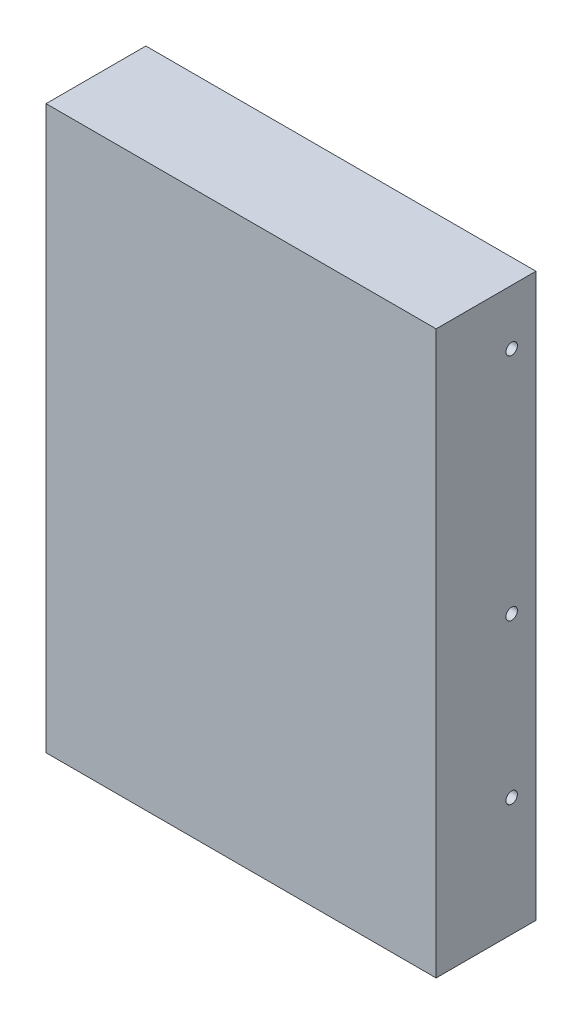
ISO-10303-21;
HEADER;
FILE_DESCRIPTION(('STEP AP214'),'2;1');
FILE_NAME('part.step','',(''),(''),'','','');
FILE_SCHEMA(('AUTOMOTIVE_DESIGN { 1 0 10303 214 1 1 1 1 }'));
ENDSEC;
DATA;
#1=APPLICATION_CONTEXT('core data for automotive mechanical design processes');
#2=APPLICATION_PROTOCOL_DEFINITION('international standard','automotive_design',2000,#1);
#3=PRODUCT_CONTEXT('',#1,'mechanical');
#4=PRODUCT('Part','Part','',(#3));
#5=PRODUCT_RELATED_PRODUCT_CATEGORY('part','',(#4));
#6=PRODUCT_DEFINITION_FORMATION('','',#4);
#7=PRODUCT_DEFINITION_CONTEXT('part definition',#1,'design');
#8=PRODUCT_DEFINITION('design','',#6,#7);
#9=PRODUCT_DEFINITION_SHAPE('','',#8);
#10=(LENGTH_UNIT() NAMED_UNIT(*) SI_UNIT(.MILLI.,.METRE.));
#11=(NAMED_UNIT(*) PLANE_ANGLE_UNIT() SI_UNIT($,.RADIAN.));
#12=(NAMED_UNIT(*) SI_UNIT($,.STERADIAN.) SOLID_ANGLE_UNIT());
#13=UNCERTAINTY_MEASURE_WITH_UNIT(LENGTH_MEASURE(1.E-05),#10,'distance_accuracy_value','');
#14=(GEOMETRIC_REPRESENTATION_CONTEXT(3) GLOBAL_UNCERTAINTY_ASSIGNED_CONTEXT((#13)) GLOBAL_UNIT_ASSIGNED_CONTEXT((#10,
#11,#12)) REPRESENTATION_CONTEXT('',''));
#15=CARTESIAN_POINT('',(0.,0.,0.));
#16=DIRECTION('',(0.,0.,1.));
#17=DIRECTION('',(1.,0.,0.));
#18=AXIS2_PLACEMENT_3D('',#15,#16,#17);
#19=CARTESIAN_POINT('',(23.934782608696,0.,2.434782608696));
#20=DIRECTION('',(0.,1.,0.));
#21=DIRECTION('',(0.,0.,1.));
#22=AXIS2_PLACEMENT_3D('',#19,#20,#21);
#23=PLANE('',#22);
#24=DIRECTION('',(1.,0.,0.));
#25=VECTOR('',#24,1.);
#26=CARTESIAN_POINT('',(33.,0.,2.));
#27=LINE('',#26,#25);
#28=CARTESIAN_POINT('',(13.,0.,2.));
#29=VERTEX_POINT('',#28);
#30=CARTESIAN_POINT('',(33.,0.,2.));
#31=VERTEX_POINT('',#30);
#32=EDGE_CURVE('E173',#29,#31,#27,.T.);
#33=ORIENTED_EDGE('',*,*,#32,.T.);
#34=DIRECTION('',(0.,0.,-1.));
#35=VECTOR('',#34,1.);
#36=CARTESIAN_POINT('',(33.,0.,1.));
#37=LINE('',#36,#35);
#38=CARTESIAN_POINT('',(33.,0.,1.));
#39=VERTEX_POINT('',#38);
#40=EDGE_CURVE('E319',#31,#39,#37,.T.);
#41=ORIENTED_EDGE('',*,*,#40,.T.);
#42=DIRECTION('',(1.,0.,0.));
#43=VECTOR('',#42,1.);
#44=CARTESIAN_POINT('',(34.,0.,1.));
#45=LINE('',#44,#43);
#46=CARTESIAN_POINT('',(34.,0.,1.));
#47=VERTEX_POINT('',#46);
#48=EDGE_CURVE('E314',#39,#47,#45,.T.);
#49=ORIENTED_EDGE('',*,*,#48,.T.);
#50=DIRECTION('',(0.,0.,1.));
#51=VECTOR('',#50,1.);
#52=CARTESIAN_POINT('',(34.,0.,3.));
#53=LINE('',#52,#51);
#54=CARTESIAN_POINT('',(34.,0.,3.));
#55=VERTEX_POINT('',#54);
#56=EDGE_CURVE('E156',#47,#55,#53,.T.);
#57=ORIENTED_EDGE('',*,*,#56,.T.);
#58=DIRECTION('',(1.,0.,0.));
#59=VECTOR('',#58,1.);
#60=CARTESIAN_POINT('',(13.,0.,3.));
#61=LINE('',#60,#59);
#62=CARTESIAN_POINT('',(13.,0.,3.));
#63=VERTEX_POINT('',#62);
#64=EDGE_CURVE('E153',#55,#63,#61,.F.);
#65=ORIENTED_EDGE('',*,*,#64,.T.);
#66=DIRECTION('',(0.,0.,1.));
#67=VECTOR('',#66,1.);
#68=CARTESIAN_POINT('',(13.,0.,3.));
#69=LINE('',#68,#67);
#70=EDGE_CURVE('E150',#29,#63,#69,.T.);
#71=ORIENTED_EDGE('',*,*,#70,.F.);
#72=EDGE_LOOP('',(#33,#41,#49,#57,#65,#71));
#73=FACE_BOUND('',#72,.T.);
#74=ADVANCED_FACE('F16',(#73),#23,.F.);
#75=CARTESIAN_POINT('',(40.994378109453,0.,2.375621890547));
#76=DIRECTION('',(0.,1.,0.));
#77=DIRECTION('',(0.,0.,1.));
#78=AXIS2_PLACEMENT_3D('',#75,#76,#77);
#79=PLANE('',#78);
#80=DIRECTION('',(0.,0.,1.));
#81=VECTOR('',#80,1.);
#82=CARTESIAN_POINT('',(37.34,0.,2.));
#83=LINE('',#82,#81);
#84=CARTESIAN_POINT('',(37.34,0.,1.));
#85=VERTEX_POINT('',#84);
#86=CARTESIAN_POINT('',(37.34,0.,2.));
#87=VERTEX_POINT('',#86);
#88=EDGE_CURVE('E296',#85,#87,#83,.T.);
#89=ORIENTED_EDGE('',*,*,#88,.T.);
#90=DIRECTION('',(1.,0.,0.));
#91=VECTOR('',#90,1.);
#92=CARTESIAN_POINT('',(46.4,0.,2.));
#93=LINE('',#92,#91);
#94=CARTESIAN_POINT('',(46.4,0.,2.));
#95=VERTEX_POINT('',#94);
#96=EDGE_CURVE('E291',#87,#95,#93,.T.);
#97=ORIENTED_EDGE('',*,*,#96,.T.);
#98=DIRECTION('',(0.,0.,1.));
#99=VECTOR('',#98,1.);
#100=CARTESIAN_POINT('',(46.4,0.,3.));
#101=LINE('',#100,#99);
#102=CARTESIAN_POINT('',(46.4,0.,3.));
#103=VERTEX_POINT('',#102);
#104=EDGE_CURVE('E286',#95,#103,#101,.T.);
#105=ORIENTED_EDGE('',*,*,#104,.T.);
#106=DIRECTION('',(1.,0.,0.));
#107=VECTOR('',#106,1.);
#108=CARTESIAN_POINT('',(36.34,0.,3.));
#109=LINE('',#108,#107);
#110=CARTESIAN_POINT('',(36.34,0.,3.));
#111=VERTEX_POINT('',#110);
#112=EDGE_CURVE('E278',#103,#111,#109,.F.);
#113=ORIENTED_EDGE('',*,*,#112,.T.);
#114=DIRECTION('',(0.,0.,-1.));
#115=VECTOR('',#114,1.);
#116=CARTESIAN_POINT('',(36.34,0.,1.));
#117=LINE('',#116,#115);
#118=CARTESIAN_POINT('',(36.34,0.,1.));
#119=VERTEX_POINT('',#118);
#120=EDGE_CURVE('E306',#111,#119,#117,.T.);
#121=ORIENTED_EDGE('',*,*,#120,.T.);
#122=DIRECTION('',(1.,0.,0.));
#123=VECTOR('',#122,1.);
#124=CARTESIAN_POINT('',(37.34,0.,1.));
#125=LINE('',#124,#123);
#126=EDGE_CURVE('E301',#119,#85,#125,.T.);
#127=ORIENTED_EDGE('',*,*,#126,.T.);
#128=EDGE_LOOP('',(#89,#97,#105,#113,#121,#127));
#129=FACE_BOUND('',#128,.T.);
#130=ADVANCED_FACE('F353',(#129),#79,.F.);
#131=CARTESIAN_POINT('',(13.,0.,3.));
#132=DIRECTION('',(0.,0.,-1.));
#133=DIRECTION('',(0.,1.,0.));
#134=AXIS2_PLACEMENT_3D('',#131,#132,#133);
#135=PLANE('',#134);
#136=DIRECTION('',(0.,1.,0.));
#137=VECTOR('',#136,1.);
#138=CARTESIAN_POINT('',(34.,0.,3.));
#139=LINE('',#138,#137);
#140=CARTESIAN_POINT('',(34.,5.,3.));
#141=VERTEX_POINT('',#140);
#142=EDGE_CURVE('E312',#55,#141,#139,.T.);
#143=ORIENTED_EDGE('',*,*,#142,.T.);
#144=DIRECTION('',(1.,0.,0.));
#145=VECTOR('',#144,1.);
#146=CARTESIAN_POINT('',(29.5,5.,3.));
#147=LINE('',#146,#145);
#148=CARTESIAN_POINT('',(13.,5.,3.));
#149=VERTEX_POINT('',#148);
#150=EDGE_CURVE('E164',#141,#149,#147,.F.);
#151=ORIENTED_EDGE('',*,*,#150,.T.);
#152=DIRECTION('',(0.,1.,0.));
#153=VECTOR('',#152,1.);
#154=CARTESIAN_POINT('',(13.,0.,3.));
#155=LINE('',#154,#153);
#156=EDGE_CURVE('E159',#63,#149,#155,.T.);
#157=ORIENTED_EDGE('',*,*,#156,.F.);
#158=ORIENTED_EDGE('',*,*,#64,.F.);
#159=EDGE_LOOP('',(#143,#151,#157,#158));
#160=FACE_BOUND('',#159,.T.);
#161=ADVANCED_FACE('F162',(#160),#135,.F.);
#162=CARTESIAN_POINT('',(13.,0.,3.));
#163=DIRECTION('',(-1.,0.,0.));
#164=DIRECTION('',(0.,0.,1.));
#165=AXIS2_PLACEMENT_3D('',#162,#163,#164);
#166=PLANE('',#165);
#167=DIRECTION('',(0.,-1.,0.));
#168=VECTOR('',#167,1.);
#169=CARTESIAN_POINT('',(13.,0.,2.));
#170=LINE('',#169,#168);
#171=CARTESIAN_POINT('',(13.,5.,2.));
#172=VERTEX_POINT('',#171);
#173=EDGE_CURVE('E171',#172,#29,#170,.T.);
#174=ORIENTED_EDGE('',*,*,#173,.T.);
#175=ORIENTED_EDGE('',*,*,#70,.T.);
#176=ORIENTED_EDGE('',*,*,#156,.T.);
#177=DIRECTION('',(0.,0.,1.));
#178=VECTOR('',#177,1.);
#179=CARTESIAN_POINT('',(13.,5.,2.25));
#180=LINE('',#179,#178);
#181=EDGE_CURVE('E275',#149,#172,#180,.F.);
#182=ORIENTED_EDGE('',*,*,#181,.T.);
#183=EDGE_LOOP('',(#174,#175,#176,#182));
#184=FACE_BOUND('',#183,.T.);
#185=ADVANCED_FACE('F170',(#184),#166,.T.);
#186=CARTESIAN_POINT('',(33.,0.,2.));
#187=DIRECTION('',(0.,0.,1.));
#188=DIRECTION('',(0.,-1.,0.));
#189=AXIS2_PLACEMENT_3D('',#186,#187,#188);
#190=PLANE('',#189);
#191=ORIENTED_EDGE('',*,*,#173,.F.);
#192=DIRECTION('',(1.,0.,0.));
#193=VECTOR('',#192,1.);
#194=CARTESIAN_POINT('',(29.5,5.,2.));
#195=LINE('',#194,#193);
#196=CARTESIAN_POINT('',(33.,5.,2.));
#197=VERTEX_POINT('',#196);
#198=EDGE_CURVE('E272',#172,#197,#195,.T.);
#199=ORIENTED_EDGE('',*,*,#198,.T.);
#200=DIRECTION('',(0.,1.,0.));
#201=VECTOR('',#200,1.);
#202=CARTESIAN_POINT('',(33.,0.,2.));
#203=LINE('',#202,#201);
#204=EDGE_CURVE('E321',#197,#31,#203,.F.);
#205=ORIENTED_EDGE('',*,*,#204,.T.);
#206=ORIENTED_EDGE('',*,*,#32,.F.);
#207=EDGE_LOOP('',(#191,#199,#205,#206));
#208=FACE_BOUND('',#207,.T.);
#209=ADVANCED_FACE('F328',(#208),#190,.F.);
#210=CARTESIAN_POINT('',(33.,0.,1.));
#211=DIRECTION('',(1.,0.,0.));
#212=DIRECTION('',(0.,0.,-1.));
#213=AXIS2_PLACEMENT_3D('',#210,#211,#212);
#214=PLANE('',#213);
#215=ORIENTED_EDGE('',*,*,#204,.F.);
#216=DIRECTION('',(0.,0.,1.));
#217=VECTOR('',#216,1.);
#218=CARTESIAN_POINT('',(33.,5.,2.25));
#219=LINE('',#218,#217);
#220=CARTESIAN_POINT('',(33.,5.,1.));
#221=VERTEX_POINT('',#220);
#222=EDGE_CURVE('E269',#197,#221,#219,.F.);
#223=ORIENTED_EDGE('',*,*,#222,.T.);
#224=DIRECTION('',(0.,-1.,0.));
#225=VECTOR('',#224,1.);
#226=CARTESIAN_POINT('',(33.,0.,1.));
#227=LINE('',#226,#225);
#228=EDGE_CURVE('E316',#221,#39,#227,.T.);
#229=ORIENTED_EDGE('',*,*,#228,.T.);
#230=ORIENTED_EDGE('',*,*,#40,.F.);
#231=EDGE_LOOP('',(#215,#223,#229,#230));
#232=FACE_BOUND('',#231,.T.);
#233=ADVANCED_FACE('F327',(#232),#214,.F.);
#234=CARTESIAN_POINT('',(34.,0.,1.));
#235=DIRECTION('',(0.,0.,1.));
#236=DIRECTION('',(0.,-1.,0.));
#237=AXIS2_PLACEMENT_3D('',#234,#235,#236);
#238=PLANE('',#237);
#239=ORIENTED_EDGE('',*,*,#228,.F.);
#240=DIRECTION('',(1.,0.,0.));
#241=VECTOR('',#240,1.);
#242=CARTESIAN_POINT('',(29.5,5.,1.));
#243=LINE('',#242,#241);
#244=CARTESIAN_POINT('',(34.,5.,1.));
#245=VERTEX_POINT('',#244);
#246=EDGE_CURVE('E266',#221,#245,#243,.T.);
#247=ORIENTED_EDGE('',*,*,#246,.T.);
#248=DIRECTION('',(0.,1.,0.));
#249=VECTOR('',#248,1.);
#250=CARTESIAN_POINT('',(34.,0.,1.));
#251=LINE('',#250,#249);
#252=EDGE_CURVE('E309',#245,#47,#251,.F.);
#253=ORIENTED_EDGE('',*,*,#252,.T.);
#254=ORIENTED_EDGE('',*,*,#48,.F.);
#255=EDGE_LOOP('',(#239,#247,#253,#254));
#256=FACE_BOUND('',#255,.T.);
#257=ADVANCED_FACE('F337',(#256),#238,.F.);
#258=CARTESIAN_POINT('',(34.,0.,3.));
#259=DIRECTION('',(-1.,0.,0.));
#260=DIRECTION('',(0.,0.,1.));
#261=AXIS2_PLACEMENT_3D('',#258,#259,#260);
#262=PLANE('',#261);
#263=ORIENTED_EDGE('',*,*,#252,.F.);
#264=DIRECTION('',(0.,0.,1.));
#265=VECTOR('',#264,1.);
#266=CARTESIAN_POINT('',(34.,5.,2.25));
#267=LINE('',#266,#265);
#268=EDGE_CURVE('E263',#245,#141,#267,.T.);
#269=ORIENTED_EDGE('',*,*,#268,.T.);
#270=ORIENTED_EDGE('',*,*,#142,.F.);
#271=ORIENTED_EDGE('',*,*,#56,.F.);
#272=EDGE_LOOP('',(#263,#269,#270,#271));
#273=FACE_BOUND('',#272,.T.);
#274=ADVANCED_FACE('F339',(#273),#262,.F.);
#275=CARTESIAN_POINT('',(36.34,0.,1.));
#276=DIRECTION('',(1.,0.,0.));
#277=DIRECTION('',(0.,0.,-1.));
#278=AXIS2_PLACEMENT_3D('',#275,#276,#277);
#279=PLANE('',#278);
#280=DIRECTION('',(0.,1.,0.));
#281=VECTOR('',#280,1.);
#282=CARTESIAN_POINT('',(36.34,0.,3.));
#283=LINE('',#282,#281);
#284=CARTESIAN_POINT('',(36.34,5.,3.));
#285=VERTEX_POINT('',#284);
#286=EDGE_CURVE('E284',#111,#285,#283,.T.);
#287=ORIENTED_EDGE('',*,*,#286,.T.);
#288=DIRECTION('',(0.,0.,1.));
#289=VECTOR('',#288,1.);
#290=CARTESIAN_POINT('',(36.34,5.,2.25));
#291=LINE('',#290,#289);
#292=CARTESIAN_POINT('',(36.34,5.,1.));
#293=VERTEX_POINT('',#292);
#294=EDGE_CURVE('E260',#285,#293,#291,.F.);
#295=ORIENTED_EDGE('',*,*,#294,.T.);
#296=DIRECTION('',(0.,-1.,0.));
#297=VECTOR('',#296,1.);
#298=CARTESIAN_POINT('',(36.34,0.,1.));
#299=LINE('',#298,#297);
#300=EDGE_CURVE('E303',#293,#119,#299,.T.);
#301=ORIENTED_EDGE('',*,*,#300,.T.);
#302=ORIENTED_EDGE('',*,*,#120,.F.);
#303=EDGE_LOOP('',(#287,#295,#301,#302));
#304=FACE_BOUND('',#303,.T.);
#305=ADVANCED_FACE('F341',(#304),#279,.F.);
#306=CARTESIAN_POINT('',(37.34,0.,1.));
#307=DIRECTION('',(0.,0.,1.));
#308=DIRECTION('',(0.,-1.,0.));
#309=AXIS2_PLACEMENT_3D('',#306,#307,#308);
#310=PLANE('',#309);
#311=ORIENTED_EDGE('',*,*,#300,.F.);
#312=DIRECTION('',(1.,0.,0.));
#313=VECTOR('',#312,1.);
#314=CARTESIAN_POINT('',(29.5,5.,1.));
#315=LINE('',#314,#313);
#316=CARTESIAN_POINT('',(37.34,5.,1.));
#317=VERTEX_POINT('',#316);
#318=EDGE_CURVE('E257',#293,#317,#315,.T.);
#319=ORIENTED_EDGE('',*,*,#318,.T.);
#320=DIRECTION('',(0.,1.,0.));
#321=VECTOR('',#320,1.);
#322=CARTESIAN_POINT('',(37.34,0.,1.));
#323=LINE('',#322,#321);
#324=EDGE_CURVE('E298',#317,#85,#323,.F.);
#325=ORIENTED_EDGE('',*,*,#324,.T.);
#326=ORIENTED_EDGE('',*,*,#126,.F.);
#327=EDGE_LOOP('',(#311,#319,#325,#326));
#328=FACE_BOUND('',#327,.T.);
#329=ADVANCED_FACE('F348',(#328),#310,.F.);
#330=CARTESIAN_POINT('',(37.34,0.,2.));
#331=DIRECTION('',(-1.,0.,0.));
#332=DIRECTION('',(0.,0.,1.));
#333=AXIS2_PLACEMENT_3D('',#330,#331,#332);
#334=PLANE('',#333);
#335=ORIENTED_EDGE('',*,*,#324,.F.);
#336=DIRECTION('',(0.,0.,1.));
#337=VECTOR('',#336,1.);
#338=CARTESIAN_POINT('',(37.34,5.,2.25));
#339=LINE('',#338,#337);
#340=CARTESIAN_POINT('',(37.34,5.,2.));
#341=VERTEX_POINT('',#340);
#342=EDGE_CURVE('E254',#317,#341,#339,.T.);
#343=ORIENTED_EDGE('',*,*,#342,.T.);
#344=DIRECTION('',(0.,-1.,0.));
#345=VECTOR('',#344,1.);
#346=CARTESIAN_POINT('',(37.34,0.,2.));
#347=LINE('',#346,#345);
#348=EDGE_CURVE('E293',#341,#87,#347,.T.);
#349=ORIENTED_EDGE('',*,*,#348,.T.);
#350=ORIENTED_EDGE('',*,*,#88,.F.);
#351=EDGE_LOOP('',(#335,#343,#349,#350));
#352=FACE_BOUND('',#351,.T.);
#353=ADVANCED_FACE('F403',(#352),#334,.F.);
#354=CARTESIAN_POINT('',(46.4,0.,2.));
#355=DIRECTION('',(0.,0.,1.));
#356=DIRECTION('',(0.,-1.,0.));
#357=AXIS2_PLACEMENT_3D('',#354,#355,#356);
#358=PLANE('',#357);
#359=ORIENTED_EDGE('',*,*,#348,.F.);
#360=DIRECTION('',(1.,0.,0.));
#361=VECTOR('',#360,1.);
#362=CARTESIAN_POINT('',(29.5,5.,2.));
#363=LINE('',#362,#361);
#364=CARTESIAN_POINT('',(46.4,5.,2.));
#365=VERTEX_POINT('',#364);
#366=EDGE_CURVE('E247',#341,#365,#363,.T.);
#367=ORIENTED_EDGE('',*,*,#366,.T.);
#368=DIRECTION('',(0.,1.,0.));
#369=VECTOR('',#368,1.);
#370=CARTESIAN_POINT('',(46.4,0.,2.));
#371=LINE('',#370,#369);
#372=EDGE_CURVE('E288',#365,#95,#371,.F.);
#373=ORIENTED_EDGE('',*,*,#372,.T.);
#374=ORIENTED_EDGE('',*,*,#96,.F.);
#375=EDGE_LOOP('',(#359,#367,#373,#374));
#376=FACE_BOUND('',#375,.T.);
#377=ADVANCED_FACE('F414',(#376),#358,.F.);
#378=CARTESIAN_POINT('',(46.4,0.,3.));
#379=DIRECTION('',(-1.,0.,0.));
#380=DIRECTION('',(0.,0.,1.));
#381=AXIS2_PLACEMENT_3D('',#378,#379,#380);
#382=PLANE('',#381);
#383=ORIENTED_EDGE('',*,*,#372,.F.);
#384=DIRECTION('',(0.,0.,1.));
#385=VECTOR('',#384,1.);
#386=CARTESIAN_POINT('',(46.4,5.,2.25));
#387=LINE('',#386,#385);
#388=CARTESIAN_POINT('',(46.4,5.,3.));
#389=VERTEX_POINT('',#388);
#390=EDGE_CURVE('E240',#365,#389,#387,.T.);
#391=ORIENTED_EDGE('',*,*,#390,.T.);
#392=DIRECTION('',(0.,1.,0.));
#393=VECTOR('',#392,1.);
#394=CARTESIAN_POINT('',(46.4,0.,3.));
#395=LINE('',#394,#393);
#396=EDGE_CURVE('E281',#389,#103,#395,.F.);
#397=ORIENTED_EDGE('',*,*,#396,.T.);
#398=ORIENTED_EDGE('',*,*,#104,.F.);
#399=EDGE_LOOP('',(#383,#391,#397,#398));
#400=FACE_BOUND('',#399,.T.);
#401=ADVANCED_FACE('F425',(#400),#382,.F.);
#402=CARTESIAN_POINT('',(36.34,0.,3.));
#403=DIRECTION('',(0.,0.,-1.));
#404=DIRECTION('',(0.,1.,0.));
#405=AXIS2_PLACEMENT_3D('',#402,#403,#404);
#406=PLANE('',#405);
#407=ORIENTED_EDGE('',*,*,#396,.F.);
#408=DIRECTION('',(1.,0.,0.));
#409=VECTOR('',#408,1.);
#410=CARTESIAN_POINT('',(29.5,5.,3.));
#411=LINE('',#410,#409);
#412=EDGE_CURVE('E236',#389,#285,#411,.F.);
#413=ORIENTED_EDGE('',*,*,#412,.T.);
#414=ORIENTED_EDGE('',*,*,#286,.F.);
#415=ORIENTED_EDGE('',*,*,#112,.F.);
#416=EDGE_LOOP('',(#407,#413,#414,#415));
#417=FACE_BOUND('',#416,.T.);
#418=ADVANCED_FACE('F436',(#417),#406,.F.);
#419=CARTESIAN_POINT('',(98.425,85.73,5.));
#420=DIRECTION('',(0.,0.,1.));
#421=DIRECTION('',(1.,0.,0.));
#422=AXIS2_PLACEMENT_3D('',#419,#420,#421);
#423=PLANE('',#422);
#424=CARTESIAN_POINT('',(98.425,85.73,5.));
#425=DIRECTION('',(0.,0.,-1.));
#426=DIRECTION('',(-1.,0.,0.));
#427=AXIS2_PLACEMENT_3D('',#424,#425,#426);
#428=CIRCLE('',#427,1.5);
#429=CARTESIAN_POINT('',(96.925,85.73,5.));
#430=VERTEX_POINT('',#429);
#431=EDGE_CURVE('E19',#430,#430,#428,.T.);
#432=ORIENTED_EDGE('',*,*,#431,.T.);
#433=EDGE_LOOP('',(#432));
#434=FACE_BOUND('',#433,.T.);
#435=ADVANCED_FACE('F447',(#434),#423,.F.);
#436=CARTESIAN_POINT('',(98.425,41.28,5.));
#437=DIRECTION('',(0.,0.,1.));
#438=DIRECTION('',(1.,0.,0.));
#439=AXIS2_PLACEMENT_3D('',#436,#437,#438);
#440=PLANE('',#439);
#441=CARTESIAN_POINT('',(98.425,41.28,5.));
#442=DIRECTION('',(0.,0.,-1.));
#443=DIRECTION('',(-1.,0.,0.));
#444=AXIS2_PLACEMENT_3D('',#441,#442,#443);
#445=CIRCLE('',#444,1.5);
#446=CARTESIAN_POINT('',(96.925,41.28,5.));
#447=VERTEX_POINT('',#446);
#448=EDGE_CURVE('E231',#447,#447,#445,.T.);
#449=ORIENTED_EDGE('',*,*,#448,.T.);
#450=EDGE_LOOP('',(#449));
#451=FACE_BOUND('',#450,.T.);
#452=ADVANCED_FACE('F457',(#451),#440,.F.);
#453=CARTESIAN_POINT('',(3.175,41.28,5.));
#454=DIRECTION('',(0.,0.,1.));
#455=DIRECTION('',(1.,0.,0.));
#456=AXIS2_PLACEMENT_3D('',#453,#454,#455);
#457=PLANE('',#456);
#458=CARTESIAN_POINT('',(3.175,41.28,5.));
#459=DIRECTION('',(0.,0.,-1.));
#460=DIRECTION('',(-1.,0.,0.));
#461=AXIS2_PLACEMENT_3D('',#458,#459,#460);
#462=CIRCLE('',#461,1.5);
#463=CARTESIAN_POINT('',(1.675,41.28,5.));
#464=VERTEX_POINT('',#463);
#465=EDGE_CURVE('E229',#464,#464,#462,.T.);
#466=ORIENTED_EDGE('',*,*,#465,.T.);
#467=EDGE_LOOP('',(#466));
#468=FACE_BOUND('',#467,.T.);
#469=ADVANCED_FACE('F467',(#468),#457,.F.);
#470=CARTESIAN_POINT('',(3.175,85.73,5.));
#471=DIRECTION('',(0.,0.,1.));
#472=DIRECTION('',(1.,0.,0.));
#473=AXIS2_PLACEMENT_3D('',#470,#471,#472);
#474=PLANE('',#473);
#475=CARTESIAN_POINT('',(3.175,85.73,5.));
#476=DIRECTION('',(0.,0.,-1.));
#477=DIRECTION('',(-1.,0.,0.));
#478=AXIS2_PLACEMENT_3D('',#475,#476,#477);
#479=CIRCLE('',#478,1.5);
#480=CARTESIAN_POINT('',(1.675,85.73,5.));
#481=VERTEX_POINT('',#480);
#482=EDGE_CURVE('E226',#481,#481,#479,.T.);
#483=ORIENTED_EDGE('',*,*,#482,.T.);
#484=EDGE_LOOP('',(#483));
#485=FACE_BOUND('',#484,.T.);
#486=ADVANCED_FACE('F477',(#485),#474,.F.);
#487=CARTESIAN_POINT('',(98.425,117.48,5.));
#488=DIRECTION('',(0.,0.,1.));
#489=DIRECTION('',(1.,0.,0.));
#490=AXIS2_PLACEMENT_3D('',#487,#488,#489);
#491=PLANE('',#490);
#492=CARTESIAN_POINT('',(98.425,117.48,5.));
#493=DIRECTION('',(0.,0.,-1.));
#494=DIRECTION('',(-1.,0.,0.));
#495=AXIS2_PLACEMENT_3D('',#492,#493,#494);
#496=CIRCLE('',#495,1.5);
#497=CARTESIAN_POINT('',(96.925,117.48,5.));
#498=VERTEX_POINT('',#497);
#499=EDGE_CURVE('E223',#498,#498,#496,.T.);
#500=ORIENTED_EDGE('',*,*,#499,.T.);
#501=EDGE_LOOP('',(#500));
#502=FACE_BOUND('',#501,.T.);
#503=ADVANCED_FACE('F488',(#502),#491,.F.);
#504=CARTESIAN_POINT('',(3.175,117.48,5.));
#505=DIRECTION('',(0.,0.,1.));
#506=DIRECTION('',(1.,0.,0.));
#507=AXIS2_PLACEMENT_3D('',#504,#505,#506);
#508=PLANE('',#507);
#509=CARTESIAN_POINT('',(3.175,117.48,5.));
#510=DIRECTION('',(0.,0.,-1.));
#511=DIRECTION('',(-1.,0.,0.));
#512=AXIS2_PLACEMENT_3D('',#509,#510,#511);
#513=CIRCLE('',#512,1.5);
#514=CARTESIAN_POINT('',(1.675,117.48,5.));
#515=VERTEX_POINT('',#514);
#516=EDGE_CURVE('E219',#515,#515,#513,.T.);
#517=ORIENTED_EDGE('',*,*,#516,.T.);
#518=EDGE_LOOP('',(#517));
#519=FACE_BOUND('',#518,.T.);
#520=ADVANCED_FACE('F499',(#519),#508,.F.);
#521=CARTESIAN_POINT('',(29.5,5.,2.25));
#522=DIRECTION('',(0.,1.,0.));
#523=DIRECTION('',(0.,0.,1.));
#524=AXIS2_PLACEMENT_3D('',#521,#522,#523);
#525=PLANE('',#524);
#526=ORIENTED_EDGE('',*,*,#390,.F.);
#527=ORIENTED_EDGE('',*,*,#366,.F.);
#528=ORIENTED_EDGE('',*,*,#342,.F.);
#529=ORIENTED_EDGE('',*,*,#318,.F.);
#530=ORIENTED_EDGE('',*,*,#294,.F.);
#531=ORIENTED_EDGE('',*,*,#412,.F.);
#532=EDGE_LOOP('',(#526,#527,#528,#529,#530,#531));
#533=FACE_BOUND('',#532,.T.);
#534=ORIENTED_EDGE('',*,*,#246,.F.);
#535=ORIENTED_EDGE('',*,*,#222,.F.);
#536=ORIENTED_EDGE('',*,*,#198,.F.);
#537=ORIENTED_EDGE('',*,*,#181,.F.);
#538=ORIENTED_EDGE('',*,*,#150,.F.);
#539=ORIENTED_EDGE('',*,*,#268,.F.);
#540=EDGE_LOOP('',(#534,#535,#536,#537,#538,#539));
#541=FACE_BOUND('',#540,.T.);
#542=DIRECTION('',(-1.,0.,0.));
#543=VECTOR('',#542,1.);
#544=CARTESIAN_POINT('',(51.,5.,0.));
#545=LINE('',#544,#543);
#546=CARTESIAN_POINT('',(48.,5.,0.));
#547=VERTEX_POINT('',#546);
#548=CARTESIAN_POINT('',(11.,5.,0.));
#549=VERTEX_POINT('',#548);
#550=EDGE_CURVE('E798',#547,#549,#545,.T.);
#551=ORIENTED_EDGE('',*,*,#550,.F.);
#552=DIRECTION('',(0.,0.,1.));
#553=VECTOR('',#552,1.);
#554=CARTESIAN_POINT('',(48.,5.,4.5));
#555=LINE('',#554,#553);
#556=CARTESIAN_POINT('',(48.,5.,4.5));
#557=VERTEX_POINT('',#556);
#558=EDGE_CURVE('E804',#557,#547,#555,.F.);
#559=ORIENTED_EDGE('',*,*,#558,.F.);
#560=DIRECTION('',(1.,0.,0.));
#561=VECTOR('',#560,1.);
#562=CARTESIAN_POINT('',(11.,5.,4.5));
#563=LINE('',#562,#561);
#564=CARTESIAN_POINT('',(11.,5.,4.5));
#565=VERTEX_POINT('',#564);
#566=EDGE_CURVE('E809',#565,#557,#563,.T.);
#567=ORIENTED_EDGE('',*,*,#566,.F.);
#568=DIRECTION('',(0.,0.,-1.));
#569=VECTOR('',#568,1.);
#570=CARTESIAN_POINT('',(11.,5.,0.));
#571=LINE('',#570,#569);
#572=EDGE_CURVE('E222',#549,#565,#571,.F.);
#573=ORIENTED_EDGE('',*,*,#572,.F.);
#574=EDGE_LOOP('',(#551,#559,#567,#573));
#575=FACE_BOUND('',#574,.T.);
#576=ADVANCED_FACE('F333',(#533,#541,#575),#525,.F.);
#577=CARTESIAN_POINT('',(98.425,85.73,0.));
#578=DIRECTION('',(0.,0.,-1.));
#579=DIRECTION('',(-1.,0.,0.));
#580=AXIS2_PLACEMENT_3D('',#577,#578,#579);
#581=CYLINDRICAL_SURFACE('',#580,1.5);
#582=ORIENTED_EDGE('',*,*,#431,.F.);
#583=EDGE_LOOP('',(#582));
#584=FACE_BOUND('',#583,.T.);
#585=CARTESIAN_POINT('',(98.425,85.73,0.));
#586=DIRECTION('',(0.,0.,-1.));
#587=DIRECTION('',(-1.,0.,0.));
#588=AXIS2_PLACEMENT_3D('',#585,#586,#587);
#589=CIRCLE('',#588,1.5);
#590=CARTESIAN_POINT('',(96.925,85.73,0.));
#591=VERTEX_POINT('',#590);
#592=EDGE_CURVE('E215',#591,#591,#589,.F.);
#593=ORIENTED_EDGE('',*,*,#592,.F.);
#594=EDGE_LOOP('',(#593));
#595=FACE_BOUND('',#594,.T.);
#596=ADVANCED_FACE('F520',(#584,#595),#581,.F.);
#597=CARTESIAN_POINT('',(98.425,41.28,0.));
#598=DIRECTION('',(0.,0.,-1.));
#599=DIRECTION('',(-1.,0.,0.));
#600=AXIS2_PLACEMENT_3D('',#597,#598,#599);
#601=CYLINDRICAL_SURFACE('',#600,1.5);
#602=ORIENTED_EDGE('',*,*,#448,.F.);
#603=EDGE_LOOP('',(#602));
#604=FACE_BOUND('',#603,.T.);
#605=CARTESIAN_POINT('',(98.425,41.28,0.));
#606=DIRECTION('',(0.,0.,-1.));
#607=DIRECTION('',(-1.,0.,0.));
#608=AXIS2_PLACEMENT_3D('',#605,#606,#607);
#609=CIRCLE('',#608,1.5);
#610=CARTESIAN_POINT('',(96.925,41.28,0.));
#611=VERTEX_POINT('',#610);
#612=EDGE_CURVE('E212',#611,#611,#609,.F.);
#613=ORIENTED_EDGE('',*,*,#612,.F.);
#614=EDGE_LOOP('',(#613));
#615=FACE_BOUND('',#614,.T.);
#616=ADVANCED_FACE('F531',(#604,#615),#601,.F.);
#617=CARTESIAN_POINT('',(3.175,41.28,0.));
#618=DIRECTION('',(0.,0.,-1.));
#619=DIRECTION('',(-1.,0.,0.));
#620=AXIS2_PLACEMENT_3D('',#617,#618,#619);
#621=CYLINDRICAL_SURFACE('',#620,1.5);
#622=ORIENTED_EDGE('',*,*,#465,.F.);
#623=EDGE_LOOP('',(#622));
#624=FACE_BOUND('',#623,.T.);
#625=CARTESIAN_POINT('',(3.175,41.28,0.));
#626=DIRECTION('',(0.,0.,-1.));
#627=DIRECTION('',(-1.,0.,0.));
#628=AXIS2_PLACEMENT_3D('',#625,#626,#627);
#629=CIRCLE('',#628,1.5);
#630=CARTESIAN_POINT('',(1.675,41.28,0.));
#631=VERTEX_POINT('',#630);
#632=EDGE_CURVE('E209',#631,#631,#629,.F.);
#633=ORIENTED_EDGE('',*,*,#632,.F.);
#634=EDGE_LOOP('',(#633));
#635=FACE_BOUND('',#634,.T.);
#636=ADVANCED_FACE('F542',(#624,#635),#621,.F.);
#637=CARTESIAN_POINT('',(3.175,85.73,0.));
#638=DIRECTION('',(0.,0.,-1.));
#639=DIRECTION('',(-1.,0.,0.));
#640=AXIS2_PLACEMENT_3D('',#637,#638,#639);
#641=CYLINDRICAL_SURFACE('',#640,1.5);
#642=ORIENTED_EDGE('',*,*,#482,.F.);
#643=EDGE_LOOP('',(#642));
#644=FACE_BOUND('',#643,.T.);
#645=CARTESIAN_POINT('',(3.175,85.73,0.));
#646=DIRECTION('',(0.,0.,-1.));
#647=DIRECTION('',(-1.,0.,0.));
#648=AXIS2_PLACEMENT_3D('',#645,#646,#647);
#649=CIRCLE('',#648,1.5);
#650=CARTESIAN_POINT('',(1.675,85.73,0.));
#651=VERTEX_POINT('',#650);
#652=EDGE_CURVE('E206',#651,#651,#649,.F.);
#653=ORIENTED_EDGE('',*,*,#652,.F.);
#654=EDGE_LOOP('',(#653));
#655=FACE_BOUND('',#654,.T.);
#656=ADVANCED_FACE('F553',(#644,#655),#641,.F.);
#657=CARTESIAN_POINT('',(98.425,117.48,0.));
#658=DIRECTION('',(0.,0.,-1.));
#659=DIRECTION('',(-1.,0.,0.));
#660=AXIS2_PLACEMENT_3D('',#657,#658,#659);
#661=CYLINDRICAL_SURFACE('',#660,1.5);
#662=ORIENTED_EDGE('',*,*,#499,.F.);
#663=EDGE_LOOP('',(#662));
#664=FACE_BOUND('',#663,.T.);
#665=CARTESIAN_POINT('',(98.425,117.48,0.));
#666=DIRECTION('',(0.,0.,-1.));
#667=DIRECTION('',(-1.,0.,0.));
#668=AXIS2_PLACEMENT_3D('',#665,#666,#667);
#669=CIRCLE('',#668,1.5);
#670=CARTESIAN_POINT('',(96.925,117.48,0.));
#671=VERTEX_POINT('',#670);
#672=EDGE_CURVE('E203',#671,#671,#669,.F.);
#673=ORIENTED_EDGE('',*,*,#672,.F.);
#674=EDGE_LOOP('',(#673));
#675=FACE_BOUND('',#674,.T.);
#676=ADVANCED_FACE('F564',(#664,#675),#661,.F.);
#677=CARTESIAN_POINT('',(3.175,117.48,0.));
#678=DIRECTION('',(0.,0.,-1.));
#679=DIRECTION('',(-1.,0.,0.));
#680=AXIS2_PLACEMENT_3D('',#677,#678,#679);
#681=CYLINDRICAL_SURFACE('',#680,1.5);
#682=ORIENTED_EDGE('',*,*,#516,.F.);
#683=EDGE_LOOP('',(#682));
#684=FACE_BOUND('',#683,.T.);
#685=CARTESIAN_POINT('',(3.175,117.48,0.));
#686=DIRECTION('',(0.,0.,-1.));
#687=DIRECTION('',(-1.,0.,0.));
#688=AXIS2_PLACEMENT_3D('',#685,#686,#687);
#689=CIRCLE('',#688,1.5);
#690=CARTESIAN_POINT('',(1.675,117.48,0.));
#691=VERTEX_POINT('',#690);
#692=EDGE_CURVE('E199',#691,#691,#689,.F.);
#693=ORIENTED_EDGE('',*,*,#692,.F.);
#694=EDGE_LOOP('',(#693));
#695=FACE_BOUND('',#694,.T.);
#696=ADVANCED_FACE('F575',(#684,#695),#681,.F.);
#697=CARTESIAN_POINT('',(11.,0.,0.));
#698=DIRECTION('',(1.,0.,0.));
#699=DIRECTION('',(0.,0.,-1.));
#700=AXIS2_PLACEMENT_3D('',#697,#698,#699);
#701=PLANE('',#700);
#702=DIRECTION('',(0.,1.,0.));
#703=VECTOR('',#702,1.);
#704=CARTESIAN_POINT('',(11.,0.,4.5));
#705=LINE('',#704,#703);
#706=CARTESIAN_POINT('',(11.,0.,4.5));
#707=VERTEX_POINT('',#706);
#708=EDGE_CURVE('E810',#707,#565,#705,.T.);
#709=ORIENTED_EDGE('',*,*,#708,.F.);
#710=DIRECTION('',(0.,0.,-1.));
#711=VECTOR('',#710,1.);
#712=CARTESIAN_POINT('',(11.,0.,0.));
#713=LINE('',#712,#711);
#714=CARTESIAN_POINT('',(11.,0.,0.));
#715=VERTEX_POINT('',#714);
#716=EDGE_CURVE('E782',#715,#707,#713,.F.);
#717=ORIENTED_EDGE('',*,*,#716,.F.);
#718=DIRECTION('',(0.,1.,0.));
#719=VECTOR('',#718,1.);
#720=CARTESIAN_POINT('',(11.,73.5,0.));
#721=LINE('',#720,#719);
#722=EDGE_CURVE('E218',#549,#715,#721,.F.);
#723=ORIENTED_EDGE('',*,*,#722,.F.);
#724=ORIENTED_EDGE('',*,*,#572,.T.);
#725=EDGE_LOOP('',(#709,#717,#723,#724));
#726=FACE_BOUND('',#725,.T.);
#727=ADVANCED_FACE('F586',(#726),#701,.T.);
#728=CARTESIAN_POINT('',(11.,0.,4.5));
#729=DIRECTION('',(0.,0.,-1.));
#730=DIRECTION('',(0.,1.,0.));
#731=AXIS2_PLACEMENT_3D('',#728,#729,#730);
#732=PLANE('',#731);
#733=DIRECTION('',(0.,1.,0.));
#734=VECTOR('',#733,1.);
#735=CARTESIAN_POINT('',(48.,0.,4.5));
#736=LINE('',#735,#734);
#737=CARTESIAN_POINT('',(48.,0.,4.5));
#738=VERTEX_POINT('',#737);
#739=EDGE_CURVE('E806',#738,#557,#736,.T.);
#740=ORIENTED_EDGE('',*,*,#739,.F.);
#741=DIRECTION('',(1.,0.,0.));
#742=VECTOR('',#741,1.);
#743=CARTESIAN_POINT('',(102.,0.,4.5));
#744=LINE('',#743,#742);
#745=EDGE_CURVE('E779',#707,#738,#744,.T.);
#746=ORIENTED_EDGE('',*,*,#745,.F.);
#747=ORIENTED_EDGE('',*,*,#708,.T.);
#748=ORIENTED_EDGE('',*,*,#566,.T.);
#749=EDGE_LOOP('',(#740,#746,#747,#748));
#750=FACE_BOUND('',#749,.T.);
#751=ADVANCED_FACE('F597',(#750),#732,.T.);
#752=CARTESIAN_POINT('',(48.,0.,4.5));
#753=DIRECTION('',(-1.,0.,0.));
#754=DIRECTION('',(0.,0.,1.));
#755=AXIS2_PLACEMENT_3D('',#752,#753,#754);
#756=PLANE('',#755);
#757=DIRECTION('',(0.,1.,0.));
#758=VECTOR('',#757,1.);
#759=CARTESIAN_POINT('',(48.,73.5,0.));
#760=LINE('',#759,#758);
#761=CARTESIAN_POINT('',(48.,0.,0.));
#762=VERTEX_POINT('',#761);
#763=EDGE_CURVE('E801',#762,#547,#760,.T.);
#764=ORIENTED_EDGE('',*,*,#763,.F.);
#765=DIRECTION('',(0.,0.,-1.));
#766=VECTOR('',#765,1.);
#767=CARTESIAN_POINT('',(48.,0.,0.));
#768=LINE('',#767,#766);
#769=EDGE_CURVE('E776',#738,#762,#768,.T.);
#770=ORIENTED_EDGE('',*,*,#769,.F.);
#771=ORIENTED_EDGE('',*,*,#739,.T.);
#772=ORIENTED_EDGE('',*,*,#558,.T.);
#773=EDGE_LOOP('',(#764,#770,#771,#772));
#774=FACE_BOUND('',#773,.T.);
#775=ADVANCED_FACE('F608',(#774),#756,.T.);
#776=CARTESIAN_POINT('',(51.,73.5,0.));
#777=DIRECTION('',(0.,0.,-1.));
#778=DIRECTION('',(-1.,0.,0.));
#779=AXIS2_PLACEMENT_3D('',#776,#777,#778);
#780=PLANE('',#779);
#781=ORIENTED_EDGE('',*,*,#692,.T.);
#782=EDGE_LOOP('',(#781));
#783=FACE_BOUND('',#782,.T.);
#784=ORIENTED_EDGE('',*,*,#672,.T.);
#785=EDGE_LOOP('',(#784));
#786=FACE_BOUND('',#785,.T.);
#787=ORIENTED_EDGE('',*,*,#652,.T.);
#788=EDGE_LOOP('',(#787));
#789=FACE_BOUND('',#788,.T.);
#790=ORIENTED_EDGE('',*,*,#632,.T.);
#791=EDGE_LOOP('',(#790));
#792=FACE_BOUND('',#791,.T.);
#793=ORIENTED_EDGE('',*,*,#612,.T.);
#794=EDGE_LOOP('',(#793));
#795=FACE_BOUND('',#794,.T.);
#796=ORIENTED_EDGE('',*,*,#592,.T.);
#797=EDGE_LOOP('',(#796));
#798=FACE_BOUND('',#797,.T.);
#799=ORIENTED_EDGE('',*,*,#722,.T.);
#800=DIRECTION('',(1.,0.,0.));
#801=VECTOR('',#800,1.);
#802=CARTESIAN_POINT('',(102.,0.,0.));
#803=LINE('',#802,#801);
#804=CARTESIAN_POINT('',(0.,0.,0.));
#805=VERTEX_POINT('',#804);
#806=EDGE_CURVE('E785',#805,#715,#803,.T.);
#807=ORIENTED_EDGE('',*,*,#806,.F.);
#808=DIRECTION('',(0.,1.,0.));
#809=VECTOR('',#808,1.);
#810=CARTESIAN_POINT('',(0.,0.,0.));
#811=LINE('',#810,#809);
#812=CARTESIAN_POINT('',(0.,147.,0.));
#813=VERTEX_POINT('',#812);
#814=EDGE_CURVE('E187',#813,#805,#811,.F.);
#815=ORIENTED_EDGE('',*,*,#814,.F.);
#816=DIRECTION('',(1.,0.,0.));
#817=VECTOR('',#816,1.);
#818=CARTESIAN_POINT('',(0.,147.,0.));
#819=LINE('',#818,#817);
#820=CARTESIAN_POINT('',(102.,147.,0.));
#821=VERTEX_POINT('',#820);
#822=EDGE_CURVE('E202',#821,#813,#819,.F.);
#823=ORIENTED_EDGE('',*,*,#822,.F.);
#824=DIRECTION('',(0.,1.,0.));
#825=VECTOR('',#824,1.);
#826=CARTESIAN_POINT('',(102.,147.,0.));
#827=LINE('',#826,#825);
#828=CARTESIAN_POINT('',(102.,0.,0.));
#829=VERTEX_POINT('',#828);
#830=EDGE_CURVE('E198',#829,#821,#827,.T.);
#831=ORIENTED_EDGE('',*,*,#830,.F.);
#832=DIRECTION('',(1.,0.,0.));
#833=VECTOR('',#832,1.);
#834=CARTESIAN_POINT('',(102.,0.,0.));
#835=LINE('',#834,#833);
#836=EDGE_CURVE('E191',#762,#829,#835,.T.);
#837=ORIENTED_EDGE('',*,*,#836,.F.);
#838=ORIENTED_EDGE('',*,*,#763,.T.);
#839=ORIENTED_EDGE('',*,*,#550,.T.);
#840=EDGE_LOOP('',(#799,#807,#815,#823,#831,#837,#838,#839));
#841=FACE_BOUND('',#840,.T.);
#842=ADVANCED_FACE('F619',(#783,#786,#789,#792,#795,#798,#841),#780,.T.);
#843=CARTESIAN_POINT('',(0.,31.,6.35));
#844=DIRECTION('',(-1.,0.,0.));
#845=DIRECTION('',(0.,0.,1.));
#846=AXIS2_PLACEMENT_3D('',#843,#844,#845);
#847=CYLINDRICAL_SURFACE('',#846,1.5);
#848=CARTESIAN_POINT('',(102.,31.,6.35000000000002));
#849=DIRECTION('',(-1.,0.,0.));
#850=DIRECTION('',(0.,0.,1.));
#851=AXIS2_PLACEMENT_3D('',#848,#849,#850);
#852=CIRCLE('',#851,1.5);
#853=CARTESIAN_POINT('',(102.,31.,7.85000000000002));
#854=VERTEX_POINT('',#853);
#855=EDGE_CURVE('E195',#854,#854,#852,.T.);
#856=ORIENTED_EDGE('',*,*,#855,.F.);
#857=EDGE_LOOP('',(#856));
#858=FACE_BOUND('',#857,.T.);
#859=CARTESIAN_POINT('',(0.,31.,6.35));
#860=DIRECTION('',(-1.,0.,0.));
#861=DIRECTION('',(0.,0.,1.));
#862=AXIS2_PLACEMENT_3D('',#859,#860,#861);
#863=CIRCLE('',#862,1.5);
#864=CARTESIAN_POINT('',(0.,31.,7.85));
#865=VERTEX_POINT('',#864);
#866=EDGE_CURVE('E184',#865,#865,#863,.F.);
#867=ORIENTED_EDGE('',*,*,#866,.F.);
#868=EDGE_LOOP('',(#867));
#869=FACE_BOUND('',#868,.T.);
#870=ADVANCED_FACE('F630',(#858,#869),#847,.F.);
#871=CARTESIAN_POINT('',(0.,72.61,6.35));
#872=DIRECTION('',(-1.,0.,0.));
#873=DIRECTION('',(0.,0.,1.));
#874=AXIS2_PLACEMENT_3D('',#871,#872,#873);
#875=CYLINDRICAL_SURFACE('',#874,1.5);
#876=CARTESIAN_POINT('',(102.,72.61,6.35000000000002));
#877=DIRECTION('',(-1.,0.,0.));
#878=DIRECTION('',(0.,0.,1.));
#879=AXIS2_PLACEMENT_3D('',#876,#877,#878);
#880=CIRCLE('',#879,1.5);
#881=CARTESIAN_POINT('',(102.,72.61,7.85000000000002));
#882=VERTEX_POINT('',#881);
#883=EDGE_CURVE('E192',#882,#882,#880,.T.);
#884=ORIENTED_EDGE('',*,*,#883,.F.);
#885=EDGE_LOOP('',(#884));
#886=FACE_BOUND('',#885,.T.);
#887=CARTESIAN_POINT('',(0.,72.61,6.35));
#888=DIRECTION('',(-1.,0.,0.));
#889=DIRECTION('',(0.,0.,1.));
#890=AXIS2_PLACEMENT_3D('',#887,#888,#889);
#891=CIRCLE('',#890,1.5);
#892=CARTESIAN_POINT('',(0.,72.61,7.85));
#893=VERTEX_POINT('',#892);
#894=EDGE_CURVE('E181',#893,#893,#891,.F.);
#895=ORIENTED_EDGE('',*,*,#894,.F.);
#896=EDGE_LOOP('',(#895));
#897=FACE_BOUND('',#896,.T.);
#898=ADVANCED_FACE('F641',(#886,#897),#875,.F.);
#899=CARTESIAN_POINT('',(0.,132.6,6.35));
#900=DIRECTION('',(-1.,0.,0.));
#901=DIRECTION('',(0.,0.,1.));
#902=AXIS2_PLACEMENT_3D('',#899,#900,#901);
#903=CYLINDRICAL_SURFACE('',#902,1.5);
#904=CARTESIAN_POINT('',(102.,132.6,6.35000000000002));
#905=DIRECTION('',(-1.,0.,0.));
#906=DIRECTION('',(0.,0.,1.));
#907=AXIS2_PLACEMENT_3D('',#904,#905,#906);
#908=CIRCLE('',#907,1.5);
#909=CARTESIAN_POINT('',(102.,132.6,7.85000000000002));
#910=VERTEX_POINT('',#909);
#911=EDGE_CURVE('E188',#910,#910,#908,.T.);
#912=ORIENTED_EDGE('',*,*,#911,.F.);
#913=EDGE_LOOP('',(#912));
#914=FACE_BOUND('',#913,.T.);
#915=CARTESIAN_POINT('',(0.,132.6,6.35));
#916=DIRECTION('',(-1.,0.,0.));
#917=DIRECTION('',(0.,0.,1.));
#918=AXIS2_PLACEMENT_3D('',#915,#916,#917);
#919=CIRCLE('',#918,1.5);
#920=CARTESIAN_POINT('',(0.,132.6,7.85));
#921=VERTEX_POINT('',#920);
#922=EDGE_CURVE('E177',#921,#921,#919,.F.);
#923=ORIENTED_EDGE('',*,*,#922,.F.);
#924=EDGE_LOOP('',(#923));
#925=FACE_BOUND('',#924,.T.);
#926=ADVANCED_FACE('F652',(#914,#925),#903,.F.);
#927=CARTESIAN_POINT('',(0.,147.,0.));
#928=DIRECTION('',(0.,1.,0.));
#929=DIRECTION('',(0.,0.,1.));
#930=AXIS2_PLACEMENT_3D('',#927,#928,#929);
#931=PLANE('',#930);
#932=DIRECTION('',(0.,0.,-1.));
#933=VECTOR('',#932,1.);
#934=CARTESIAN_POINT('',(102.,147.,0.));
#935=LINE('',#934,#933);
#936=CARTESIAN_POINT('',(102.,147.,26.1));
#937=VERTEX_POINT('',#936);
#938=EDGE_CURVE('E794',#821,#937,#935,.F.);
#939=ORIENTED_EDGE('',*,*,#938,.F.);
#940=ORIENTED_EDGE('',*,*,#822,.T.);
#941=DIRECTION('',(0.,0.,1.));
#942=VECTOR('',#941,1.);
#943=CARTESIAN_POINT('',(0.,147.,0.));
#944=LINE('',#943,#942);
#945=CARTESIAN_POINT('',(0.,147.,26.1));
#946=VERTEX_POINT('',#945);
#947=EDGE_CURVE('E772',#946,#813,#944,.F.);
#948=ORIENTED_EDGE('',*,*,#947,.F.);
#949=DIRECTION('',(-1.,0.,0.));
#950=VECTOR('',#949,1.);
#951=CARTESIAN_POINT('',(51.,147.,26.1));
#952=LINE('',#951,#950);
#953=EDGE_CURVE('E180',#946,#937,#952,.F.);
#954=ORIENTED_EDGE('',*,*,#953,.T.);
#955=EDGE_LOOP('',(#939,#940,#948,#954));
#956=FACE_BOUND('',#955,.T.);
#957=ADVANCED_FACE('F663',(#956),#931,.T.);
#958=CARTESIAN_POINT('',(102.,147.,0.));
#959=DIRECTION('',(1.,0.,0.));
#960=DIRECTION('',(0.,0.,-1.));
#961=AXIS2_PLACEMENT_3D('',#958,#959,#960);
#962=PLANE('',#961);
#963=ORIENTED_EDGE('',*,*,#911,.T.);
#964=EDGE_LOOP('',(#963));
#965=FACE_BOUND('',#964,.T.);
#966=ORIENTED_EDGE('',*,*,#883,.T.);
#967=EDGE_LOOP('',(#966));
#968=FACE_BOUND('',#967,.T.);
#969=ORIENTED_EDGE('',*,*,#855,.T.);
#970=EDGE_LOOP('',(#969));
#971=FACE_BOUND('',#970,.T.);
#972=DIRECTION('',(0.,0.,-1.));
#973=VECTOR('',#972,1.);
#974=CARTESIAN_POINT('',(102.,0.,0.));
#975=LINE('',#974,#973);
#976=CARTESIAN_POINT('',(102.,0.,26.1));
#977=VERTEX_POINT('',#976);
#978=EDGE_CURVE('E788',#829,#977,#975,.F.);
#979=ORIENTED_EDGE('',*,*,#978,.F.);
#980=ORIENTED_EDGE('',*,*,#830,.T.);
#981=ORIENTED_EDGE('',*,*,#938,.T.);
#982=DIRECTION('',(0.,1.,0.));
#983=VECTOR('',#982,1.);
#984=CARTESIAN_POINT('',(102.,73.5,26.1));
#985=LINE('',#984,#983);
#986=EDGE_CURVE('E765',#937,#977,#985,.F.);
#987=ORIENTED_EDGE('',*,*,#986,.T.);
#988=EDGE_LOOP('',(#979,#980,#981,#987));
#989=FACE_BOUND('',#988,.T.);
#990=ADVANCED_FACE('F674',(#965,#968,#971,#989),#962,.T.);
#991=CARTESIAN_POINT('',(102.,0.,0.));
#992=DIRECTION('',(0.,-1.,0.));
#993=DIRECTION('',(0.,0.,-1.));
#994=AXIS2_PLACEMENT_3D('',#991,#992,#993);
#995=PLANE('',#994);
#996=ORIENTED_EDGE('',*,*,#745,.T.);
#997=ORIENTED_EDGE('',*,*,#769,.T.);
#998=ORIENTED_EDGE('',*,*,#836,.T.);
#999=ORIENTED_EDGE('',*,*,#978,.T.);
#1000=DIRECTION('',(-1.,0.,0.));
#1001=VECTOR('',#1000,1.);
#1002=CARTESIAN_POINT('',(51.,0.,26.1));
#1003=LINE('',#1002,#1001);
#1004=CARTESIAN_POINT('',(0.,0.,26.1));
#1005=VERTEX_POINT('',#1004);
#1006=EDGE_CURVE('E25',#977,#1005,#1003,.T.);
#1007=ORIENTED_EDGE('',*,*,#1006,.T.);
#1008=DIRECTION('',(0.,0.,1.));
#1009=VECTOR('',#1008,1.);
#1010=CARTESIAN_POINT('',(0.,0.,0.));
#1011=LINE('',#1010,#1009);
#1012=EDGE_CURVE('E33',#805,#1005,#1011,.T.);
#1013=ORIENTED_EDGE('',*,*,#1012,.F.);
#1014=ORIENTED_EDGE('',*,*,#806,.T.);
#1015=ORIENTED_EDGE('',*,*,#716,.T.);
#1016=EDGE_LOOP('',(#996,#997,#998,#999,#1007,#1013,#1014,#1015));
#1017=FACE_BOUND('',#1016,.T.);
#1018=ADVANCED_FACE('F685',(#1017),#995,.T.);
#1019=CARTESIAN_POINT('',(0.,0.,0.));
#1020=DIRECTION('',(-1.,0.,0.));
#1021=DIRECTION('',(0.,0.,1.));
#1022=AXIS2_PLACEMENT_3D('',#1019,#1020,#1021);
#1023=PLANE('',#1022);
#1024=ORIENTED_EDGE('',*,*,#922,.T.);
#1025=EDGE_LOOP('',(#1024));
#1026=FACE_BOUND('',#1025,.T.);
#1027=ORIENTED_EDGE('',*,*,#894,.T.);
#1028=EDGE_LOOP('',(#1027));
#1029=FACE_BOUND('',#1028,.T.);
#1030=ORIENTED_EDGE('',*,*,#866,.T.);
#1031=EDGE_LOOP('',(#1030));
#1032=FACE_BOUND('',#1031,.T.);
#1033=ORIENTED_EDGE('',*,*,#947,.T.);
#1034=ORIENTED_EDGE('',*,*,#814,.T.);
#1035=ORIENTED_EDGE('',*,*,#1012,.T.);
#1036=DIRECTION('',(0.,1.,0.));
#1037=VECTOR('',#1036,1.);
#1038=CARTESIAN_POINT('',(0.,73.5,26.1));
#1039=LINE('',#1038,#1037);
#1040=EDGE_CURVE('E10',#1005,#946,#1039,.T.);
#1041=ORIENTED_EDGE('',*,*,#1040,.T.);
#1042=EDGE_LOOP('',(#1033,#1034,#1035,#1041));
#1043=FACE_BOUND('',#1042,.T.);
#1044=ADVANCED_FACE('F696',(#1026,#1029,#1032,#1043),#1023,.T.);
#1045=CARTESIAN_POINT('',(51.,73.5,26.1));
#1046=DIRECTION('',(0.,0.,-1.));
#1047=DIRECTION('',(-1.,0.,0.));
#1048=AXIS2_PLACEMENT_3D('',#1045,#1046,#1047);
#1049=PLANE('',#1048);
#1050=ORIENTED_EDGE('',*,*,#1006,.F.);
#1051=ORIENTED_EDGE('',*,*,#986,.F.);
#1052=ORIENTED_EDGE('',*,*,#953,.F.);
#1053=ORIENTED_EDGE('',*,*,#1040,.F.);
#1054=EDGE_LOOP('',(#1050,#1051,#1052,#1053));
#1055=FACE_BOUND('',#1054,.T.);
#1056=ADVANCED_FACE('F707',(#1055),#1049,.F.);
#1057=CLOSED_SHELL('',(#74,#130,#161,#185,#209,#233,#257,#274,#305,#329,#353,#377,#401,#418,
#435,#452,#469,#486,#503,#520,#576,#596,#616,#636,#656,#676,#696,#727,#751,#775,#842,#870,#898,
#926,#957,#990,#1018,#1044,#1056));
#1058=MANIFOLD_SOLID_BREP('B1',#1057);
#1059=ADVANCED_BREP_SHAPE_REPRESENTATION('',(#18,#1058),#14);
#1060=SHAPE_DEFINITION_REPRESENTATION(#9,#1059);
ENDSEC;
END-ISO-10303-21;
